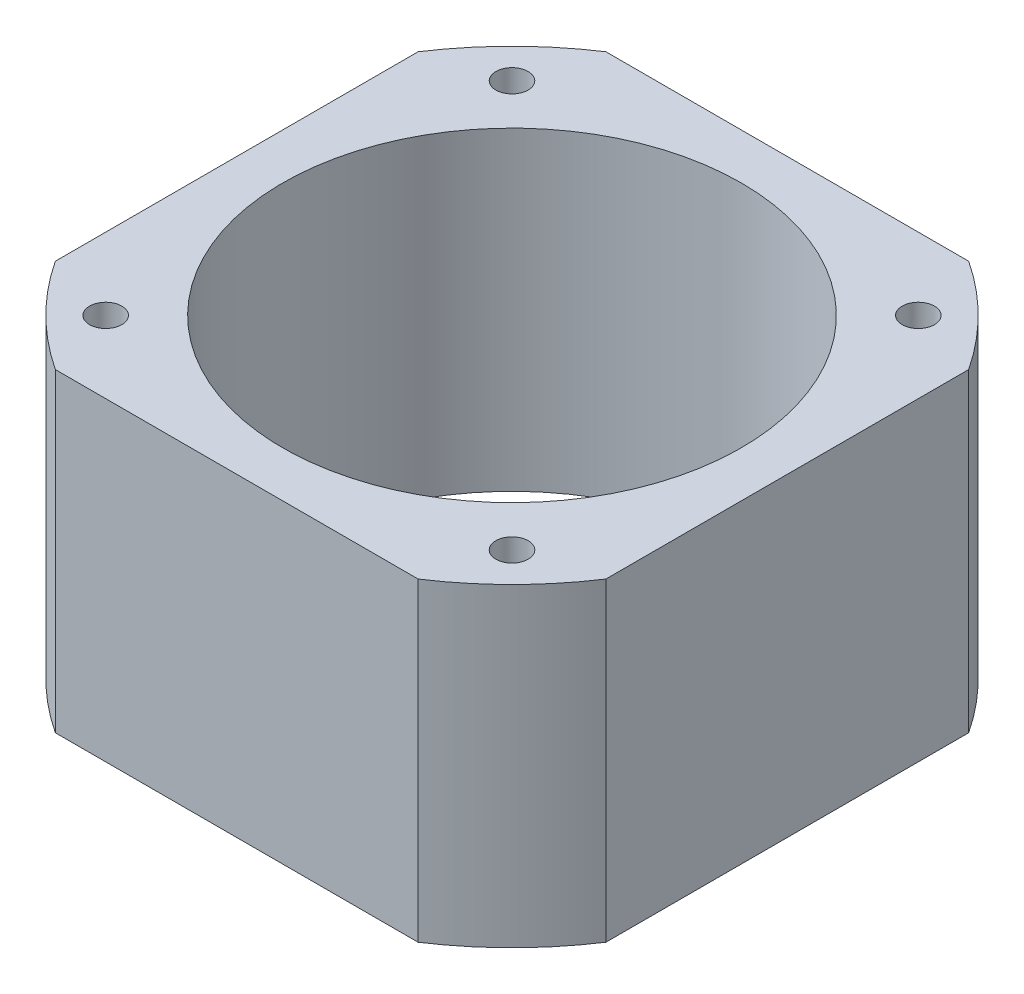
ISO-10303-21;
HEADER;
FILE_DESCRIPTION(('STEP AP214'),'2;1');
FILE_NAME('part.step','',(''),(''),'','','');
FILE_SCHEMA(('AUTOMOTIVE_DESIGN { 1 0 10303 214 1 1 1 1 }'));
ENDSEC;
DATA;
#1=APPLICATION_CONTEXT('core data for automotive mechanical design processes');
#2=APPLICATION_PROTOCOL_DEFINITION('international standard','automotive_design',2000,#1);
#3=PRODUCT_CONTEXT('',#1,'mechanical');
#4=PRODUCT('Part','Part','',(#3));
#5=PRODUCT_RELATED_PRODUCT_CATEGORY('part','',(#4));
#6=PRODUCT_DEFINITION_FORMATION('','',#4);
#7=PRODUCT_DEFINITION_CONTEXT('part definition',#1,'design');
#8=PRODUCT_DEFINITION('design','',#6,#7);
#9=PRODUCT_DEFINITION_SHAPE('','',#8);
#10=(LENGTH_UNIT() NAMED_UNIT(*) SI_UNIT(.MILLI.,.METRE.));
#11=(NAMED_UNIT(*) PLANE_ANGLE_UNIT() SI_UNIT($,.RADIAN.));
#12=(NAMED_UNIT(*) SI_UNIT($,.STERADIAN.) SOLID_ANGLE_UNIT());
#13=UNCERTAINTY_MEASURE_WITH_UNIT(LENGTH_MEASURE(1.E-05),#10,'distance_accuracy_value','');
#14=(GEOMETRIC_REPRESENTATION_CONTEXT(3) GLOBAL_UNCERTAINTY_ASSIGNED_CONTEXT((#13)) GLOBAL_UNIT_ASSIGNED_CONTEXT((#10,
#11,#12)) REPRESENTATION_CONTEXT('',''));
#15=CARTESIAN_POINT('',(0.,0.,0.));
#16=DIRECTION('',(0.,0.,1.));
#17=DIRECTION('',(1.,0.,0.));
#18=AXIS2_PLACEMENT_3D('',#15,#16,#17);
#19=CARTESIAN_POINT('',(13.839165437265,0.,-21.));
#20=DIRECTION('',(0.,0.,1.));
#21=DIRECTION('',(0.,-1.,0.));
#22=AXIS2_PLACEMENT_3D('',#19,#20,#21);
#23=PLANE('',#22);
#24=DIRECTION('',(0.,-1.,0.));
#25=VECTOR('',#24,1.);
#26=CARTESIAN_POINT('',(-13.8391654372616,0.,-21.0000000000025));
#27=LINE('',#26,#25);
#28=CARTESIAN_POINT('',(-13.8391654372635,24.,-21.0000000000012));
#29=VERTEX_POINT('',#28);
#30=CARTESIAN_POINT('',(-13.8391654372635,0.,-21.0000000000012));
#31=VERTEX_POINT('',#30);
#32=EDGE_CURVE('E79',#29,#31,#27,.T.);
#33=ORIENTED_EDGE('',*,*,#32,.F.);
#34=DIRECTION('',(1.,0.,0.));
#35=VECTOR('',#34,1.);
#36=CARTESIAN_POINT('',(0.,24.,-21.));
#37=LINE('',#36,#35);
#38=CARTESIAN_POINT('',(13.8391654372652,24.,-21.0000000000001));
#39=VERTEX_POINT('',#38);
#40=EDGE_CURVE('E147',#39,#29,#37,.F.);
#41=ORIENTED_EDGE('',*,*,#40,.F.);
#42=DIRECTION('',(0.,-1.,0.));
#43=VECTOR('',#42,1.);
#44=CARTESIAN_POINT('',(13.8391654372651,0.,-21.0000000000002));
#45=LINE('',#44,#43);
#46=CARTESIAN_POINT('',(13.8391654372652,0.,-21.0000000000001));
#47=VERTEX_POINT('',#46);
#48=EDGE_CURVE('E109',#47,#39,#45,.F.);
#49=ORIENTED_EDGE('',*,*,#48,.F.);
#50=DIRECTION('',(1.,0.,0.));
#51=VECTOR('',#50,1.);
#52=CARTESIAN_POINT('',(0.,0.,-21.));
#53=LINE('',#52,#51);
#54=EDGE_CURVE('E104',#47,#31,#53,.F.);
#55=ORIENTED_EDGE('',*,*,#54,.T.);
#56=EDGE_LOOP('',(#33,#41,#49,#55));
#57=FACE_BOUND('',#56,.T.);
#58=ADVANCED_FACE('F16',(#57),#23,.F.);
#59=CARTESIAN_POINT('',(0.,0.,0.));
#60=DIRECTION('',(0.,-1.,0.));
#61=DIRECTION('',(0.,0.,-1.));
#62=AXIS2_PLACEMENT_3D('',#59,#60,#61);
#63=CYLINDRICAL_SURFACE('',#62,25.15);
#64=CARTESIAN_POINT('',(0.,24.,0.));
#65=DIRECTION('',(0.,-1.,0.));
#66=DIRECTION('',(0.,0.,-1.));
#67=AXIS2_PLACEMENT_3D('',#64,#65,#66);
#68=CIRCLE('',#67,25.15);
#69=CARTESIAN_POINT('',(-21.,24.,-13.8391654372627));
#70=VERTEX_POINT('',#69);
#71=EDGE_CURVE('E145',#29,#70,#68,.F.);
#72=ORIENTED_EDGE('',*,*,#71,.F.);
#73=ORIENTED_EDGE('',*,*,#32,.T.);
#74=CARTESIAN_POINT('',(0.,0.,0.));
#75=DIRECTION('',(0.,-1.,0.));
#76=DIRECTION('',(0.,0.,-1.));
#77=AXIS2_PLACEMENT_3D('',#74,#75,#76);
#78=CIRCLE('',#77,25.15);
#79=CARTESIAN_POINT('',(-21.,0.,-13.8391654372627));
#80=VERTEX_POINT('',#79);
#81=EDGE_CURVE('E19',#31,#80,#78,.F.);
#82=ORIENTED_EDGE('',*,*,#81,.T.);
#83=DIRECTION('',(0.,1.,0.));
#84=VECTOR('',#83,1.);
#85=CARTESIAN_POINT('',(-21.,0.,-13.83916543726));
#86=LINE('',#85,#84);
#87=EDGE_CURVE('E86',#80,#70,#86,.T.);
#88=ORIENTED_EDGE('',*,*,#87,.T.);
#89=EDGE_LOOP('',(#72,#73,#82,#88));
#90=FACE_BOUND('',#89,.T.);
#91=ADVANCED_FACE('F103',(#90),#63,.T.);
#92=CARTESIAN_POINT('',(-21.,0.,-13.83916543726));
#93=DIRECTION('',(1.,0.,0.));
#94=DIRECTION('',(0.,0.,-1.));
#95=AXIS2_PLACEMENT_3D('',#92,#93,#94);
#96=PLANE('',#95);
#97=DIRECTION('',(0.,-1.,0.));
#98=VECTOR('',#97,1.);
#99=CARTESIAN_POINT('',(-21.0000000000002,0.,13.8391654372651));
#100=LINE('',#99,#98);
#101=CARTESIAN_POINT('',(-21.0000000000001,24.,13.8391654372652));
#102=VERTEX_POINT('',#101);
#103=CARTESIAN_POINT('',(-21.0000000000001,0.,13.8391654372652));
#104=VERTEX_POINT('',#103);
#105=EDGE_CURVE('E92',#102,#104,#100,.T.);
#106=ORIENTED_EDGE('',*,*,#105,.F.);
#107=DIRECTION('',(0.,0.,1.));
#108=VECTOR('',#107,1.);
#109=CARTESIAN_POINT('',(-21.,24.,0.));
#110=LINE('',#109,#108);
#111=EDGE_CURVE('E91',#70,#102,#110,.T.);
#112=ORIENTED_EDGE('',*,*,#111,.F.);
#113=ORIENTED_EDGE('',*,*,#87,.F.);
#114=DIRECTION('',(0.,0.,1.));
#115=VECTOR('',#114,1.);
#116=CARTESIAN_POINT('',(-21.,0.,0.));
#117=LINE('',#116,#115);
#118=EDGE_CURVE('E90',#80,#104,#117,.T.);
#119=ORIENTED_EDGE('',*,*,#118,.T.);
#120=EDGE_LOOP('',(#106,#112,#113,#119));
#121=FACE_BOUND('',#120,.T.);
#122=ADVANCED_FACE('F89',(#121),#96,.F.);
#123=CARTESIAN_POINT('',(0.,0.,0.));
#124=DIRECTION('',(0.,-1.,0.));
#125=DIRECTION('',(0.,0.,-1.));
#126=AXIS2_PLACEMENT_3D('',#123,#124,#125);
#127=CYLINDRICAL_SURFACE('',#126,25.15);
#128=CARTESIAN_POINT('',(0.,24.,0.));
#129=DIRECTION('',(0.,-1.,0.));
#130=DIRECTION('',(0.,0.,-1.));
#131=AXIS2_PLACEMENT_3D('',#128,#129,#130);
#132=CIRCLE('',#131,25.15);
#133=CARTESIAN_POINT('',(-13.8391654372627,24.,21.));
#134=VERTEX_POINT('',#133);
#135=EDGE_CURVE('E143',#102,#134,#132,.F.);
#136=ORIENTED_EDGE('',*,*,#135,.F.);
#137=ORIENTED_EDGE('',*,*,#105,.T.);
#138=CARTESIAN_POINT('',(0.,0.,0.));
#139=DIRECTION('',(0.,-1.,0.));
#140=DIRECTION('',(0.,0.,-1.));
#141=AXIS2_PLACEMENT_3D('',#138,#139,#140);
#142=CIRCLE('',#141,25.15);
#143=CARTESIAN_POINT('',(-13.8391654372627,0.,21.));
#144=VERTEX_POINT('',#143);
#145=EDGE_CURVE('E101',#104,#144,#142,.F.);
#146=ORIENTED_EDGE('',*,*,#145,.T.);
#147=DIRECTION('',(0.,1.,0.));
#148=VECTOR('',#147,1.);
#149=CARTESIAN_POINT('',(-13.83916543726,0.,21.));
#150=LINE('',#149,#148);
#151=EDGE_CURVE('E119',#144,#134,#150,.T.);
#152=ORIENTED_EDGE('',*,*,#151,.T.);
#153=EDGE_LOOP('',(#136,#137,#146,#152));
#154=FACE_BOUND('',#153,.T.);
#155=ADVANCED_FACE('F192',(#154),#127,.T.);
#156=CARTESIAN_POINT('',(-13.83916543726,0.,21.));
#157=DIRECTION('',(0.,0.,-1.));
#158=DIRECTION('',(0.,1.,0.));
#159=AXIS2_PLACEMENT_3D('',#156,#157,#158);
#160=PLANE('',#159);
#161=DIRECTION('',(0.,-1.,0.));
#162=VECTOR('',#161,1.);
#163=CARTESIAN_POINT('',(13.8391654372651,0.,21.0000000000002));
#164=LINE('',#163,#162);
#165=CARTESIAN_POINT('',(13.8391654372652,24.,21.0000000000001));
#166=VERTEX_POINT('',#165);
#167=CARTESIAN_POINT('',(13.8391654372652,0.,21.0000000000001));
#168=VERTEX_POINT('',#167);
#169=EDGE_CURVE('E117',#166,#168,#164,.T.);
#170=ORIENTED_EDGE('',*,*,#169,.F.);
#171=DIRECTION('',(1.,0.,0.));
#172=VECTOR('',#171,1.);
#173=CARTESIAN_POINT('',(0.,24.,21.));
#174=LINE('',#173,#172);
#175=EDGE_CURVE('E142',#134,#166,#174,.T.);
#176=ORIENTED_EDGE('',*,*,#175,.F.);
#177=ORIENTED_EDGE('',*,*,#151,.F.);
#178=DIRECTION('',(1.,0.,0.));
#179=VECTOR('',#178,1.);
#180=CARTESIAN_POINT('',(0.,0.,21.));
#181=LINE('',#180,#179);
#182=EDGE_CURVE('E166',#144,#168,#181,.T.);
#183=ORIENTED_EDGE('',*,*,#182,.T.);
#184=EDGE_LOOP('',(#170,#176,#177,#183));
#185=FACE_BOUND('',#184,.T.);
#186=ADVANCED_FACE('F181',(#185),#160,.F.);
#187=CARTESIAN_POINT('',(0.,0.,0.));
#188=DIRECTION('',(0.,-1.,0.));
#189=DIRECTION('',(0.,0.,-1.));
#190=AXIS2_PLACEMENT_3D('',#187,#188,#189);
#191=CYLINDRICAL_SURFACE('',#190,25.15);
#192=CARTESIAN_POINT('',(0.,24.,0.));
#193=DIRECTION('',(0.,-1.,0.));
#194=DIRECTION('',(0.,0.,-1.));
#195=AXIS2_PLACEMENT_3D('',#192,#193,#194);
#196=CIRCLE('',#195,25.15);
#197=CARTESIAN_POINT('',(21.,24.,13.8391654372652));
#198=VERTEX_POINT('',#197);
#199=EDGE_CURVE('E140',#166,#198,#196,.F.);
#200=ORIENTED_EDGE('',*,*,#199,.F.);
#201=ORIENTED_EDGE('',*,*,#169,.T.);
#202=CARTESIAN_POINT('',(0.,0.,0.));
#203=DIRECTION('',(0.,-1.,0.));
#204=DIRECTION('',(0.,0.,-1.));
#205=AXIS2_PLACEMENT_3D('',#202,#203,#204);
#206=CIRCLE('',#205,25.15);
#207=CARTESIAN_POINT('',(21.,0.,13.8391654372652));
#208=VERTEX_POINT('',#207);
#209=EDGE_CURVE('E164',#168,#208,#206,.F.);
#210=ORIENTED_EDGE('',*,*,#209,.T.);
#211=DIRECTION('',(0.,1.,0.));
#212=VECTOR('',#211,1.);
#213=CARTESIAN_POINT('',(21.,0.,13.839165437265));
#214=LINE('',#213,#212);
#215=EDGE_CURVE('E113',#208,#198,#214,.T.);
#216=ORIENTED_EDGE('',*,*,#215,.T.);
#217=EDGE_LOOP('',(#200,#201,#210,#216));
#218=FACE_BOUND('',#217,.T.);
#219=ADVANCED_FACE('F184',(#218),#191,.T.);
#220=CARTESIAN_POINT('',(21.,0.,13.839165437265));
#221=DIRECTION('',(-1.,0.,0.));
#222=DIRECTION('',(0.,0.,1.));
#223=AXIS2_PLACEMENT_3D('',#220,#221,#222);
#224=PLANE('',#223);
#225=DIRECTION('',(0.,-1.,0.));
#226=VECTOR('',#225,1.);
#227=CARTESIAN_POINT('',(21.0000000000024,0.,-13.8391654372616));
#228=LINE('',#227,#226);
#229=CARTESIAN_POINT('',(21.0000000000012,24.,-13.8391654372635));
#230=VERTEX_POINT('',#229);
#231=CARTESIAN_POINT('',(21.0000000000012,0.,-13.8391654372635));
#232=VERTEX_POINT('',#231);
#233=EDGE_CURVE('E105',#230,#232,#228,.T.);
#234=ORIENTED_EDGE('',*,*,#233,.F.);
#235=DIRECTION('',(0.,0.,1.));
#236=VECTOR('',#235,1.);
#237=CARTESIAN_POINT('',(21.,24.,0.));
#238=LINE('',#237,#236);
#239=EDGE_CURVE('E34',#198,#230,#238,.F.);
#240=ORIENTED_EDGE('',*,*,#239,.F.);
#241=ORIENTED_EDGE('',*,*,#215,.F.);
#242=DIRECTION('',(0.,0.,1.));
#243=VECTOR('',#242,1.);
#244=CARTESIAN_POINT('',(21.,0.,0.));
#245=LINE('',#244,#243);
#246=EDGE_CURVE('E163',#208,#232,#245,.F.);
#247=ORIENTED_EDGE('',*,*,#246,.T.);
#248=EDGE_LOOP('',(#234,#240,#241,#247));
#249=FACE_BOUND('',#248,.T.);
#250=ADVANCED_FACE('F186',(#249),#224,.F.);
#251=CARTESIAN_POINT('',(0.,0.,0.));
#252=DIRECTION('',(0.,-1.,0.));
#253=DIRECTION('',(0.,0.,-1.));
#254=AXIS2_PLACEMENT_3D('',#251,#252,#253);
#255=CYLINDRICAL_SURFACE('',#254,25.15);
#256=CARTESIAN_POINT('',(0.,24.,0.));
#257=DIRECTION('',(0.,-1.,0.));
#258=DIRECTION('',(0.,0.,-1.));
#259=AXIS2_PLACEMENT_3D('',#256,#257,#258);
#260=CIRCLE('',#259,25.15);
#261=EDGE_CURVE('E138',#230,#39,#260,.F.);
#262=ORIENTED_EDGE('',*,*,#261,.F.);
#263=ORIENTED_EDGE('',*,*,#233,.T.);
#264=CARTESIAN_POINT('',(0.,0.,0.));
#265=DIRECTION('',(0.,-1.,0.));
#266=DIRECTION('',(0.,0.,-1.));
#267=AXIS2_PLACEMENT_3D('',#264,#265,#266);
#268=CIRCLE('',#267,25.15);
#269=EDGE_CURVE('E160',#232,#47,#268,.F.);
#270=ORIENTED_EDGE('',*,*,#269,.T.);
#271=ORIENTED_EDGE('',*,*,#48,.T.);
#272=EDGE_LOOP('',(#262,#263,#270,#271));
#273=FACE_BOUND('',#272,.T.);
#274=ADVANCED_FACE('F190',(#273),#255,.T.);
#275=CARTESIAN_POINT('',(-15.5,0.,-15.5));
#276=DIRECTION('',(0.,-1.,0.));
#277=DIRECTION('',(0.,0.,-1.));
#278=AXIS2_PLACEMENT_3D('',#275,#276,#277);
#279=CYLINDRICAL_SURFACE('',#278,1.23);
#280=CARTESIAN_POINT('',(-15.5,24.,-15.5));
#281=DIRECTION('',(0.,-1.,0.));
#282=DIRECTION('',(0.,0.,-1.));
#283=AXIS2_PLACEMENT_3D('',#280,#281,#282);
#284=CIRCLE('',#283,1.23);
#285=CARTESIAN_POINT('',(-15.5,24.,-16.73));
#286=VERTEX_POINT('',#285);
#287=EDGE_CURVE('E135',#286,#286,#284,.T.);
#288=ORIENTED_EDGE('',*,*,#287,.F.);
#289=EDGE_LOOP('',(#288));
#290=FACE_BOUND('',#289,.T.);
#291=CARTESIAN_POINT('',(-15.5,0.,-15.5));
#292=DIRECTION('',(0.,-1.,0.));
#293=DIRECTION('',(0.,0.,-1.));
#294=AXIS2_PLACEMENT_3D('',#291,#292,#293);
#295=CIRCLE('',#294,1.23);
#296=CARTESIAN_POINT('',(-15.5,0.,-16.73));
#297=VERTEX_POINT('',#296);
#298=EDGE_CURVE('E157',#297,#297,#295,.T.);
#299=ORIENTED_EDGE('',*,*,#298,.T.);
#300=EDGE_LOOP('',(#299));
#301=FACE_BOUND('',#300,.T.);
#302=ADVANCED_FACE('F228',(#290,#301),#279,.F.);
#303=CARTESIAN_POINT('',(-15.5,0.,15.5));
#304=DIRECTION('',(0.,-1.,0.));
#305=DIRECTION('',(0.,0.,-1.));
#306=AXIS2_PLACEMENT_3D('',#303,#304,#305);
#307=CYLINDRICAL_SURFACE('',#306,1.23);
#308=CARTESIAN_POINT('',(-15.5,24.,15.5));
#309=DIRECTION('',(0.,-1.,0.));
#310=DIRECTION('',(0.,0.,-1.));
#311=AXIS2_PLACEMENT_3D('',#308,#309,#310);
#312=CIRCLE('',#311,1.23);
#313=CARTESIAN_POINT('',(-15.5,24.,14.27));
#314=VERTEX_POINT('',#313);
#315=EDGE_CURVE('E132',#314,#314,#312,.T.);
#316=ORIENTED_EDGE('',*,*,#315,.F.);
#317=EDGE_LOOP('',(#316));
#318=FACE_BOUND('',#317,.T.);
#319=CARTESIAN_POINT('',(-15.5,0.,15.5));
#320=DIRECTION('',(0.,-1.,0.));
#321=DIRECTION('',(0.,0.,-1.));
#322=AXIS2_PLACEMENT_3D('',#319,#320,#321);
#323=CIRCLE('',#322,1.23);
#324=CARTESIAN_POINT('',(-15.5,0.,14.27));
#325=VERTEX_POINT('',#324);
#326=EDGE_CURVE('E154',#325,#325,#323,.T.);
#327=ORIENTED_EDGE('',*,*,#326,.T.);
#328=EDGE_LOOP('',(#327));
#329=FACE_BOUND('',#328,.T.);
#330=ADVANCED_FACE('F224',(#318,#329),#307,.F.);
#331=CARTESIAN_POINT('',(15.5,0.,-15.5));
#332=DIRECTION('',(0.,-1.,0.));
#333=DIRECTION('',(0.,0.,-1.));
#334=AXIS2_PLACEMENT_3D('',#331,#332,#333);
#335=CYLINDRICAL_SURFACE('',#334,1.23);
#336=CARTESIAN_POINT('',(15.5,24.,-15.5));
#337=DIRECTION('',(0.,-1.,0.));
#338=DIRECTION('',(0.,0.,-1.));
#339=AXIS2_PLACEMENT_3D('',#336,#337,#338);
#340=CIRCLE('',#339,1.23);
#341=CARTESIAN_POINT('',(15.5,24.,-16.73));
#342=VERTEX_POINT('',#341);
#343=EDGE_CURVE('E129',#342,#342,#340,.T.);
#344=ORIENTED_EDGE('',*,*,#343,.F.);
#345=EDGE_LOOP('',(#344));
#346=FACE_BOUND('',#345,.T.);
#347=CARTESIAN_POINT('',(15.5,0.,-15.5));
#348=DIRECTION('',(0.,-1.,0.));
#349=DIRECTION('',(0.,0.,-1.));
#350=AXIS2_PLACEMENT_3D('',#347,#348,#349);
#351=CIRCLE('',#350,1.23);
#352=CARTESIAN_POINT('',(15.5,0.,-16.73));
#353=VERTEX_POINT('',#352);
#354=EDGE_CURVE('E151',#353,#353,#351,.T.);
#355=ORIENTED_EDGE('',*,*,#354,.T.);
#356=EDGE_LOOP('',(#355));
#357=FACE_BOUND('',#356,.T.);
#358=ADVANCED_FACE('F220',(#346,#357),#335,.F.);
#359=CARTESIAN_POINT('',(15.5,0.,15.5));
#360=DIRECTION('',(0.,-1.,0.));
#361=DIRECTION('',(0.,0.,-1.));
#362=AXIS2_PLACEMENT_3D('',#359,#360,#361);
#363=CYLINDRICAL_SURFACE('',#362,1.23);
#364=CARTESIAN_POINT('',(15.5,24.,15.5));
#365=DIRECTION('',(0.,-1.,0.));
#366=DIRECTION('',(0.,0.,-1.));
#367=AXIS2_PLACEMENT_3D('',#364,#365,#366);
#368=CIRCLE('',#367,1.23);
#369=CARTESIAN_POINT('',(15.5,24.,14.27));
#370=VERTEX_POINT('',#369);
#371=EDGE_CURVE('E126',#370,#370,#368,.T.);
#372=ORIENTED_EDGE('',*,*,#371,.F.);
#373=EDGE_LOOP('',(#372));
#374=FACE_BOUND('',#373,.T.);
#375=CARTESIAN_POINT('',(15.5,0.,15.5));
#376=DIRECTION('',(0.,-1.,0.));
#377=DIRECTION('',(0.,0.,-1.));
#378=AXIS2_PLACEMENT_3D('',#375,#376,#377);
#379=CIRCLE('',#378,1.23);
#380=CARTESIAN_POINT('',(15.5,0.,14.27));
#381=VERTEX_POINT('',#380);
#382=EDGE_CURVE('E148',#381,#381,#379,.T.);
#383=ORIENTED_EDGE('',*,*,#382,.T.);
#384=EDGE_LOOP('',(#383));
#385=FACE_BOUND('',#384,.T.);
#386=ADVANCED_FACE('F216',(#374,#385),#363,.F.);
#387=CARTESIAN_POINT('',(0.,0.,0.));
#388=DIRECTION('',(0.,1.,0.));
#389=DIRECTION('',(0.,0.,1.));
#390=AXIS2_PLACEMENT_3D('',#387,#388,#389);
#391=PLANE('',#390);
#392=ORIENTED_EDGE('',*,*,#382,.F.);
#393=EDGE_LOOP('',(#392));
#394=FACE_BOUND('',#393,.T.);
#395=CARTESIAN_POINT('',(0.,0.,0.));
#396=DIRECTION('',(0.,-1.,0.));
#397=DIRECTION('',(0.,0.,-1.));
#398=AXIS2_PLACEMENT_3D('',#395,#396,#397);
#399=CIRCLE('',#398,17.5);
#400=CARTESIAN_POINT('',(0.,0.,-17.5));
#401=VERTEX_POINT('',#400);
#402=EDGE_CURVE('E25',#401,#401,#399,.F.);
#403=ORIENTED_EDGE('',*,*,#402,.T.);
#404=EDGE_LOOP('',(#403));
#405=FACE_BOUND('',#404,.T.);
#406=ORIENTED_EDGE('',*,*,#354,.F.);
#407=EDGE_LOOP('',(#406));
#408=FACE_BOUND('',#407,.T.);
#409=ORIENTED_EDGE('',*,*,#326,.F.);
#410=EDGE_LOOP('',(#409));
#411=FACE_BOUND('',#410,.T.);
#412=ORIENTED_EDGE('',*,*,#298,.F.);
#413=EDGE_LOOP('',(#412));
#414=FACE_BOUND('',#413,.T.);
#415=ORIENTED_EDGE('',*,*,#246,.F.);
#416=ORIENTED_EDGE('',*,*,#209,.F.);
#417=ORIENTED_EDGE('',*,*,#182,.F.);
#418=ORIENTED_EDGE('',*,*,#145,.F.);
#419=ORIENTED_EDGE('',*,*,#118,.F.);
#420=ORIENTED_EDGE('',*,*,#81,.F.);
#421=ORIENTED_EDGE('',*,*,#54,.F.);
#422=ORIENTED_EDGE('',*,*,#269,.F.);
#423=EDGE_LOOP('',(#415,#416,#417,#418,#419,#420,#421,#422));
#424=FACE_BOUND('',#423,.T.);
#425=ADVANCED_FACE('F97',(#394,#405,#408,#411,#414,#424),#391,.F.);
#426=CARTESIAN_POINT('',(0.,24.,0.));
#427=DIRECTION('',(0.,1.,0.));
#428=DIRECTION('',(0.,0.,1.));
#429=AXIS2_PLACEMENT_3D('',#426,#427,#428);
#430=PLANE('',#429);
#431=ORIENTED_EDGE('',*,*,#371,.T.);
#432=EDGE_LOOP('',(#431));
#433=FACE_BOUND('',#432,.T.);
#434=CARTESIAN_POINT('',(0.,24.,0.));
#435=DIRECTION('',(0.,-1.,0.));
#436=DIRECTION('',(0.,0.,-1.));
#437=AXIS2_PLACEMENT_3D('',#434,#435,#436);
#438=CIRCLE('',#437,17.5);
#439=CARTESIAN_POINT('',(0.,24.,-17.5));
#440=VERTEX_POINT('',#439);
#441=EDGE_CURVE('E11',#440,#440,#438,.T.);
#442=ORIENTED_EDGE('',*,*,#441,.T.);
#443=EDGE_LOOP('',(#442));
#444=FACE_BOUND('',#443,.T.);
#445=ORIENTED_EDGE('',*,*,#343,.T.);
#446=EDGE_LOOP('',(#445));
#447=FACE_BOUND('',#446,.T.);
#448=ORIENTED_EDGE('',*,*,#315,.T.);
#449=EDGE_LOOP('',(#448));
#450=FACE_BOUND('',#449,.T.);
#451=ORIENTED_EDGE('',*,*,#287,.T.);
#452=EDGE_LOOP('',(#451));
#453=FACE_BOUND('',#452,.T.);
#454=ORIENTED_EDGE('',*,*,#239,.T.);
#455=ORIENTED_EDGE('',*,*,#261,.T.);
#456=ORIENTED_EDGE('',*,*,#40,.T.);
#457=ORIENTED_EDGE('',*,*,#71,.T.);
#458=ORIENTED_EDGE('',*,*,#111,.T.);
#459=ORIENTED_EDGE('',*,*,#135,.T.);
#460=ORIENTED_EDGE('',*,*,#175,.T.);
#461=ORIENTED_EDGE('',*,*,#199,.T.);
#462=EDGE_LOOP('',(#454,#455,#456,#457,#458,#459,#460,#461));
#463=FACE_BOUND('',#462,.T.);
#464=ADVANCED_FACE('F178',(#433,#444,#447,#450,#453,#463),#430,.T.);
#465=CARTESIAN_POINT('',(0.,0.,0.));
#466=DIRECTION('',(0.,-1.,0.));
#467=DIRECTION('',(0.,0.,-1.));
#468=AXIS2_PLACEMENT_3D('',#465,#466,#467);
#469=CYLINDRICAL_SURFACE('',#468,17.5);
#470=ORIENTED_EDGE('',*,*,#441,.F.);
#471=EDGE_LOOP('',(#470));
#472=FACE_BOUND('',#471,.T.);
#473=ORIENTED_EDGE('',*,*,#402,.F.);
#474=EDGE_LOOP('',(#473));
#475=FACE_BOUND('',#474,.T.);
#476=ADVANCED_FACE('F202',(#472,#475),#469,.F.);
#477=CLOSED_SHELL('',(#58,#91,#122,#155,#186,#219,#250,#274,#302,#330,#358,#386,#425,#464,#476));
#478=MANIFOLD_SOLID_BREP('B1',#477);
#479=ADVANCED_BREP_SHAPE_REPRESENTATION('',(#18,#478),#14);
#480=SHAPE_DEFINITION_REPRESENTATION(#9,#479);
ENDSEC;
END-ISO-10303-21;
